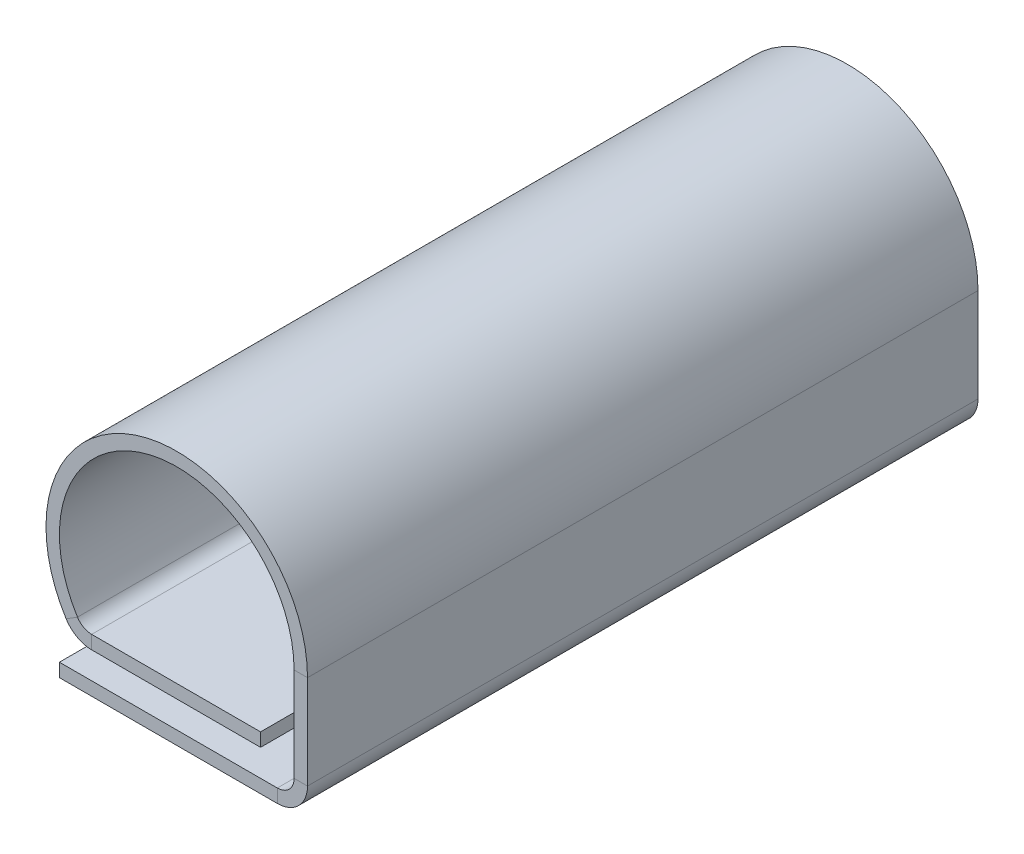
ISO-10303-21;
HEADER;
FILE_DESCRIPTION(('STEP AP214'),'2;1');
FILE_NAME('part.step','',(''),(''),'','','');
FILE_SCHEMA(('AUTOMOTIVE_DESIGN { 1 0 10303 214 1 1 1 1 }'));
ENDSEC;
DATA;
#1=APPLICATION_CONTEXT('core data for automotive mechanical design processes');
#2=APPLICATION_PROTOCOL_DEFINITION('international standard','automotive_design',2000,#1);
#3=PRODUCT_CONTEXT('',#1,'mechanical');
#4=PRODUCT('Part','Part','',(#3));
#5=PRODUCT_RELATED_PRODUCT_CATEGORY('part','',(#4));
#6=PRODUCT_DEFINITION_FORMATION('','',#4);
#7=PRODUCT_DEFINITION_CONTEXT('part definition',#1,'design');
#8=PRODUCT_DEFINITION('design','',#6,#7);
#9=PRODUCT_DEFINITION_SHAPE('','',#8);
#10=(LENGTH_UNIT() NAMED_UNIT(*) SI_UNIT(.MILLI.,.METRE.));
#11=(NAMED_UNIT(*) PLANE_ANGLE_UNIT() SI_UNIT($,.RADIAN.));
#12=(NAMED_UNIT(*) SI_UNIT($,.STERADIAN.) SOLID_ANGLE_UNIT());
#13=UNCERTAINTY_MEASURE_WITH_UNIT(LENGTH_MEASURE(1.E-05),#10,'distance_accuracy_value','');
#14=(GEOMETRIC_REPRESENTATION_CONTEXT(3) GLOBAL_UNCERTAINTY_ASSIGNED_CONTEXT((#13)) GLOBAL_UNIT_ASSIGNED_CONTEXT((#10,
#11,#12)) REPRESENTATION_CONTEXT('',''));
#15=CARTESIAN_POINT('',(0.,0.,0.));
#16=DIRECTION('',(0.,0.,1.));
#17=DIRECTION('',(1.,0.,0.));
#18=AXIS2_PLACEMENT_3D('',#15,#16,#17);
#19=CARTESIAN_POINT('',(1.95,1.65,10.));
#20=DIRECTION('',(0.,0.,1.));
#21=DIRECTION('',(1.,0.,0.));
#22=AXIS2_PLACEMENT_3D('',#19,#20,#21);
#23=PLANE('',#22);
#24=DIRECTION('',(-1.,0.,0.));
#25=VECTOR('',#24,1.);
#26=CARTESIAN_POINT('',(1.95,1.65,10.));
#27=LINE('',#26,#25);
#28=CARTESIAN_POINT('',(1.95,1.65,10.));
#29=VERTEX_POINT('',#28);
#30=CARTESIAN_POINT('',(1.75,1.65,10.));
#31=VERTEX_POINT('',#30);
#32=EDGE_CURVE('E11',#29,#31,#27,.T.);
#33=ORIENTED_EDGE('',*,*,#32,.F.);
#34=CARTESIAN_POINT('',(0.,1.65,10.));
#35=DIRECTION('',(0.,0.,1.));
#36=DIRECTION('',(1.,0.,0.));
#37=AXIS2_PLACEMENT_3D('',#34,#35,#36);
#38=CIRCLE('',#37,1.95);
#39=CARTESIAN_POINT('',(-1.64951508025844,0.61,10.));
#40=VERTEX_POINT('',#39);
#41=EDGE_CURVE('E145',#29,#40,#38,.T.);
#42=ORIENTED_EDGE('',*,*,#41,.T.);
#43=DIRECTION('',(0.845905169363302,0.533333333333333,0.));
#44=VECTOR('',#43,1.);
#45=CARTESIAN_POINT('',(-1.64951508025844,0.61,10.));
#46=LINE('',#45,#44);
#47=CARTESIAN_POINT('',(-1.48033404638578,0.716666666666667,10.));
#48=VERTEX_POINT('',#47);
#49=EDGE_CURVE('E250',#40,#48,#46,.T.);
#50=ORIENTED_EDGE('',*,*,#49,.T.);
#51=CARTESIAN_POINT('',(0.,1.65,10.));
#52=DIRECTION('',(0.,0.,1.));
#53=DIRECTION('',(1.,0.,0.));
#54=AXIS2_PLACEMENT_3D('',#51,#52,#53);
#55=CIRCLE('',#54,1.75);
#56=EDGE_CURVE('E148',#31,#48,#55,.T.);
#57=ORIENTED_EDGE('',*,*,#56,.F.);
#58=EDGE_LOOP('',(#33,#42,#50,#57));
#59=FACE_BOUND('',#58,.T.);
#60=ADVANCED_FACE('F34',(#59),#23,.T.);
#61=CARTESIAN_POINT('',(1.75,1.65,0.));
#62=DIRECTION('',(0.,0.,-1.));
#63=DIRECTION('',(-1.,0.,0.));
#64=AXIS2_PLACEMENT_3D('',#61,#62,#63);
#65=PLANE('',#64);
#66=DIRECTION('',(1.,0.,0.));
#67=VECTOR('',#66,1.);
#68=CARTESIAN_POINT('',(1.75,1.65,0.));
#69=LINE('',#68,#67);
#70=CARTESIAN_POINT('',(1.75,1.65,0.));
#71=VERTEX_POINT('',#70);
#72=CARTESIAN_POINT('',(1.95,1.65,0.));
#73=VERTEX_POINT('',#72);
#74=EDGE_CURVE('E42',#71,#73,#69,.T.);
#75=ORIENTED_EDGE('',*,*,#74,.F.);
#76=CARTESIAN_POINT('',(0.,1.65,0.));
#77=DIRECTION('',(0.,0.,1.));
#78=DIRECTION('',(1.,0.,0.));
#79=AXIS2_PLACEMENT_3D('',#76,#77,#78);
#80=CIRCLE('',#79,1.75);
#81=CARTESIAN_POINT('',(-1.48033404638578,0.716666666666667,0.));
#82=VERTEX_POINT('',#81);
#83=EDGE_CURVE('E193',#71,#82,#80,.T.);
#84=ORIENTED_EDGE('',*,*,#83,.T.);
#85=DIRECTION('',(-0.845905169363302,-0.533333333333333,0.));
#86=VECTOR('',#85,1.);
#87=CARTESIAN_POINT('',(-1.48033404638578,0.716666666666667,0.));
#88=LINE('',#87,#86);
#89=CARTESIAN_POINT('',(-1.64951508025844,0.61,0.));
#90=VERTEX_POINT('',#89);
#91=EDGE_CURVE('E97',#82,#90,#88,.T.);
#92=ORIENTED_EDGE('',*,*,#91,.T.);
#93=CARTESIAN_POINT('',(0.,1.65,0.));
#94=DIRECTION('',(0.,0.,1.));
#95=DIRECTION('',(1.,0.,0.));
#96=AXIS2_PLACEMENT_3D('',#93,#94,#95);
#97=CIRCLE('',#96,1.95);
#98=EDGE_CURVE('E214',#73,#90,#97,.T.);
#99=ORIENTED_EDGE('',*,*,#98,.F.);
#100=EDGE_LOOP('',(#75,#84,#92,#99));
#101=FACE_BOUND('',#100,.T.);
#102=ADVANCED_FACE('F262',(#101),#65,.T.);
#103=CARTESIAN_POINT('',(1.75,0.25,10.));
#104=DIRECTION('',(0.,0.,1.));
#105=DIRECTION('',(1.,0.,0.));
#106=AXIS2_PLACEMENT_3D('',#103,#104,#105);
#107=PLANE('',#106);
#108=DIRECTION('',(1.,0.,0.));
#109=VECTOR('',#108,1.);
#110=CARTESIAN_POINT('',(1.75,0.25,10.));
#111=LINE('',#110,#109);
#112=CARTESIAN_POINT('',(1.75,0.25,10.));
#113=VERTEX_POINT('',#112);
#114=CARTESIAN_POINT('',(1.95,0.25,10.));
#115=VERTEX_POINT('',#114);
#116=EDGE_CURVE('E157',#113,#115,#111,.T.);
#117=ORIENTED_EDGE('',*,*,#116,.F.);
#118=CARTESIAN_POINT('',(1.5,0.25,10.));
#119=DIRECTION('',(0.,0.,-1.));
#120=DIRECTION('',(-1.,0.,0.));
#121=AXIS2_PLACEMENT_3D('',#118,#119,#120);
#122=CIRCLE('',#121,0.25);
#123=CARTESIAN_POINT('',(1.5,0.,10.));
#124=VERTEX_POINT('',#123);
#125=EDGE_CURVE('E302',#124,#113,#122,.F.);
#126=ORIENTED_EDGE('',*,*,#125,.F.);
#127=DIRECTION('',(0.,1.,0.));
#128=VECTOR('',#127,1.);
#129=CARTESIAN_POINT('',(1.5,-0.2,10.));
#130=LINE('',#129,#128);
#131=CARTESIAN_POINT('',(1.5,-0.2,10.));
#132=VERTEX_POINT('',#131);
#133=EDGE_CURVE('E257',#132,#124,#130,.T.);
#134=ORIENTED_EDGE('',*,*,#133,.F.);
#135=CARTESIAN_POINT('',(1.5,0.25,10.));
#136=DIRECTION('',(0.,0.,1.));
#137=DIRECTION('',(1.,0.,0.));
#138=AXIS2_PLACEMENT_3D('',#135,#136,#137);
#139=CIRCLE('',#138,0.45);
#140=EDGE_CURVE('E161',#132,#115,#139,.T.);
#141=ORIENTED_EDGE('',*,*,#140,.T.);
#142=EDGE_LOOP('',(#117,#126,#134,#141));
#143=FACE_BOUND('',#142,.T.);
#144=ADVANCED_FACE('F316',(#143),#107,.T.);
#145=CARTESIAN_POINT('',(1.5,-0.2,10.));
#146=DIRECTION('',(0.,0.,1.));
#147=DIRECTION('',(1.,0.,0.));
#148=AXIS2_PLACEMENT_3D('',#145,#146,#147);
#149=PLANE('',#148);
#150=DIRECTION('',(0.,1.,0.));
#151=VECTOR('',#150,1.);
#152=CARTESIAN_POINT('',(1.75,0.,10.));
#153=LINE('',#152,#151);
#154=EDGE_CURVE('E267',#113,#31,#153,.T.);
#155=ORIENTED_EDGE('',*,*,#154,.F.);
#156=ORIENTED_EDGE('',*,*,#116,.T.);
#157=DIRECTION('',(0.,1.,0.));
#158=VECTOR('',#157,1.);
#159=CARTESIAN_POINT('',(1.95,0.,10.));
#160=LINE('',#159,#158);
#161=EDGE_CURVE('E154',#115,#29,#160,.T.);
#162=ORIENTED_EDGE('',*,*,#161,.T.);
#163=ORIENTED_EDGE('',*,*,#32,.T.);
#164=EDGE_LOOP('',(#155,#156,#162,#163));
#165=FACE_BOUND('',#164,.T.);
#166=ADVANCED_FACE('F156',(#165),#149,.T.);
#167=CARTESIAN_POINT('',(1.5,0.,0.));
#168=DIRECTION('',(0.,0.,-1.));
#169=DIRECTION('',(-1.,0.,0.));
#170=AXIS2_PLACEMENT_3D('',#167,#168,#169);
#171=PLANE('',#170);
#172=DIRECTION('',(0.,-1.,0.));
#173=VECTOR('',#172,1.);
#174=CARTESIAN_POINT('',(1.5,0.,0.));
#175=LINE('',#174,#173);
#176=CARTESIAN_POINT('',(1.5,0.,0.));
#177=VERTEX_POINT('',#176);
#178=CARTESIAN_POINT('',(1.5,-0.2,0.));
#179=VERTEX_POINT('',#178);
#180=EDGE_CURVE('E255',#177,#179,#175,.T.);
#181=ORIENTED_EDGE('',*,*,#180,.F.);
#182=CARTESIAN_POINT('',(1.5,0.25,0.));
#183=DIRECTION('',(0.,0.,-1.));
#184=DIRECTION('',(-1.,0.,0.));
#185=AXIS2_PLACEMENT_3D('',#182,#183,#184);
#186=CIRCLE('',#185,0.25);
#187=CARTESIAN_POINT('',(1.75,0.25,0.));
#188=VERTEX_POINT('',#187);
#189=EDGE_CURVE('E198',#177,#188,#186,.F.);
#190=ORIENTED_EDGE('',*,*,#189,.T.);
#191=DIRECTION('',(-1.,0.,0.));
#192=VECTOR('',#191,1.);
#193=CARTESIAN_POINT('',(1.95,0.25,0.));
#194=LINE('',#193,#192);
#195=CARTESIAN_POINT('',(1.95,0.25,0.));
#196=VERTEX_POINT('',#195);
#197=EDGE_CURVE('E253',#196,#188,#194,.T.);
#198=ORIENTED_EDGE('',*,*,#197,.F.);
#199=CARTESIAN_POINT('',(1.5,0.25,0.));
#200=DIRECTION('',(0.,0.,1.));
#201=DIRECTION('',(1.,0.,0.));
#202=AXIS2_PLACEMENT_3D('',#199,#200,#201);
#203=CIRCLE('',#202,0.45);
#204=EDGE_CURVE('E210',#179,#196,#203,.T.);
#205=ORIENTED_EDGE('',*,*,#204,.F.);
#206=EDGE_LOOP('',(#181,#190,#198,#205));
#207=FACE_BOUND('',#206,.T.);
#208=ADVANCED_FACE('F323',(#207),#171,.T.);
#209=CARTESIAN_POINT('',(1.95,0.25,0.));
#210=DIRECTION('',(0.,0.,-1.));
#211=DIRECTION('',(-1.,0.,0.));
#212=AXIS2_PLACEMENT_3D('',#209,#210,#211);
#213=PLANE('',#212);
#214=DIRECTION('',(1.,0.,0.));
#215=VECTOR('',#214,1.);
#216=CARTESIAN_POINT('',(-1.75,0.,0.));
#217=LINE('',#216,#215);
#218=CARTESIAN_POINT('',(-1.75,0.,0.));
#219=VERTEX_POINT('',#218);
#220=EDGE_CURVE('E201',#219,#177,#217,.T.);
#221=ORIENTED_EDGE('',*,*,#220,.T.);
#222=ORIENTED_EDGE('',*,*,#180,.T.);
#223=DIRECTION('',(1.,0.,0.));
#224=VECTOR('',#223,1.);
#225=CARTESIAN_POINT('',(-1.75,-0.2,0.));
#226=LINE('',#225,#224);
#227=CARTESIAN_POINT('',(-1.75,-0.2,0.));
#228=VERTEX_POINT('',#227);
#229=EDGE_CURVE('E207',#228,#179,#226,.T.);
#230=ORIENTED_EDGE('',*,*,#229,.F.);
#231=DIRECTION('',(0.,1.,0.));
#232=VECTOR('',#231,1.);
#233=CARTESIAN_POINT('',(-1.75,-0.2,0.));
#234=LINE('',#233,#232);
#235=EDGE_CURVE('E204',#228,#219,#234,.T.);
#236=ORIENTED_EDGE('',*,*,#235,.T.);
#237=EDGE_LOOP('',(#221,#222,#230,#236));
#238=FACE_BOUND('',#237,.T.);
#239=ADVANCED_FACE('F343',(#238),#213,.T.);
#240=CARTESIAN_POINT('',(-1.26885775404495,0.6,10.));
#241=DIRECTION('',(0.,0.,1.));
#242=DIRECTION('',(1.,0.,0.));
#243=AXIS2_PLACEMENT_3D('',#240,#241,#242);
#244=PLANE('',#243);
#245=DIRECTION('',(0.,-1.,0.));
#246=VECTOR('',#245,1.);
#247=CARTESIAN_POINT('',(-1.26885775404495,0.6,10.));
#248=LINE('',#247,#246);
#249=CARTESIAN_POINT('',(-1.26885775404495,0.6,10.));
#250=VERTEX_POINT('',#249);
#251=CARTESIAN_POINT('',(-1.26885775404495,0.4,10.));
#252=VERTEX_POINT('',#251);
#253=EDGE_CURVE('E50',#250,#252,#248,.T.);
#254=ORIENTED_EDGE('',*,*,#253,.F.);
#255=CARTESIAN_POINT('',(-1.26885775404495,0.85,10.));
#256=DIRECTION('',(0.,0.,1.));
#257=DIRECTION('',(1.,0.,0.));
#258=AXIS2_PLACEMENT_3D('',#255,#256,#257);
#259=CIRCLE('',#258,0.25);
#260=EDGE_CURVE('E295',#48,#250,#259,.T.);
#261=ORIENTED_EDGE('',*,*,#260,.F.);
#262=ORIENTED_EDGE('',*,*,#49,.F.);
#263=CARTESIAN_POINT('',(-1.26885775404495,0.85,10.));
#264=DIRECTION('',(0.,0.,1.));
#265=DIRECTION('',(1.,0.,0.));
#266=AXIS2_PLACEMENT_3D('',#263,#264,#265);
#267=CIRCLE('',#266,0.45);
#268=EDGE_CURVE('E176',#40,#252,#267,.T.);
#269=ORIENTED_EDGE('',*,*,#268,.T.);
#270=EDGE_LOOP('',(#254,#261,#262,#269));
#271=FACE_BOUND('',#270,.T.);
#272=ADVANCED_FACE('F345',(#271),#244,.T.);
#273=CARTESIAN_POINT('',(-1.64951508025844,0.61,10.));
#274=DIRECTION('',(0.,0.,1.));
#275=DIRECTION('',(1.,0.,0.));
#276=AXIS2_PLACEMENT_3D('',#273,#274,#275);
#277=PLANE('',#276);
#278=DIRECTION('',(1.,0.,0.));
#279=VECTOR('',#278,1.);
#280=CARTESIAN_POINT('',(-1.4,0.6,10.));
#281=LINE('',#280,#279);
#282=CARTESIAN_POINT('',(1.25,0.6,10.));
#283=VERTEX_POINT('',#282);
#284=EDGE_CURVE('E293',#250,#283,#281,.T.);
#285=ORIENTED_EDGE('',*,*,#284,.F.);
#286=ORIENTED_EDGE('',*,*,#253,.T.);
#287=DIRECTION('',(1.,0.,0.));
#288=VECTOR('',#287,1.);
#289=CARTESIAN_POINT('',(-1.4,0.4,10.));
#290=LINE('',#289,#288);
#291=CARTESIAN_POINT('',(1.25,0.4,10.));
#292=VERTEX_POINT('',#291);
#293=EDGE_CURVE('E110',#252,#292,#290,.T.);
#294=ORIENTED_EDGE('',*,*,#293,.T.);
#295=DIRECTION('',(0.,-1.,0.));
#296=VECTOR('',#295,1.);
#297=CARTESIAN_POINT('',(1.25,0.6,10.));
#298=LINE('',#297,#296);
#299=EDGE_CURVE('E291',#283,#292,#298,.T.);
#300=ORIENTED_EDGE('',*,*,#299,.F.);
#301=EDGE_LOOP('',(#285,#286,#294,#300));
#302=FACE_BOUND('',#301,.T.);
#303=ADVANCED_FACE('F351',(#302),#277,.T.);
#304=CARTESIAN_POINT('',(-1.48033404638578,0.716666666666667,0.));
#305=DIRECTION('',(0.,0.,-1.));
#306=DIRECTION('',(-1.,0.,0.));
#307=AXIS2_PLACEMENT_3D('',#304,#305,#306);
#308=PLANE('',#307);
#309=ORIENTED_EDGE('',*,*,#91,.F.);
#310=CARTESIAN_POINT('',(-1.26885775404495,0.85,0.));
#311=DIRECTION('',(0.,0.,1.));
#312=DIRECTION('',(1.,0.,0.));
#313=AXIS2_PLACEMENT_3D('',#310,#311,#312);
#314=CIRCLE('',#313,0.25);
#315=CARTESIAN_POINT('',(-1.26885775404495,0.6,0.));
#316=VERTEX_POINT('',#315);
#317=EDGE_CURVE('E191',#82,#316,#314,.T.);
#318=ORIENTED_EDGE('',*,*,#317,.T.);
#319=DIRECTION('',(0.,1.,0.));
#320=VECTOR('',#319,1.);
#321=CARTESIAN_POINT('',(-1.26885775404495,0.4,0.));
#322=LINE('',#321,#320);
#323=CARTESIAN_POINT('',(-1.26885775404495,0.4,0.));
#324=VERTEX_POINT('',#323);
#325=EDGE_CURVE('E104',#324,#316,#322,.T.);
#326=ORIENTED_EDGE('',*,*,#325,.F.);
#327=CARTESIAN_POINT('',(-1.26885775404495,0.85,0.));
#328=DIRECTION('',(0.,0.,1.));
#329=DIRECTION('',(1.,0.,0.));
#330=AXIS2_PLACEMENT_3D('',#327,#328,#329);
#331=CIRCLE('',#330,0.45);
#332=EDGE_CURVE('E216',#90,#324,#331,.T.);
#333=ORIENTED_EDGE('',*,*,#332,.F.);
#334=EDGE_LOOP('',(#309,#318,#326,#333));
#335=FACE_BOUND('',#334,.T.);
#336=ADVANCED_FACE('F278',(#335),#308,.T.);
#337=CARTESIAN_POINT('',(-1.26885775404495,0.4,0.));
#338=DIRECTION('',(0.,0.,-1.));
#339=DIRECTION('',(-1.,0.,0.));
#340=AXIS2_PLACEMENT_3D('',#337,#338,#339);
#341=PLANE('',#340);
#342=DIRECTION('',(0.,1.,0.));
#343=VECTOR('',#342,1.);
#344=CARTESIAN_POINT('',(1.75,0.,0.));
#345=LINE('',#344,#343);
#346=EDGE_CURVE('E195',#188,#71,#345,.T.);
#347=ORIENTED_EDGE('',*,*,#346,.T.);
#348=ORIENTED_EDGE('',*,*,#74,.T.);
#349=DIRECTION('',(0.,1.,0.));
#350=VECTOR('',#349,1.);
#351=CARTESIAN_POINT('',(1.95,0.,0.));
#352=LINE('',#351,#350);
#353=EDGE_CURVE('E168',#196,#73,#352,.T.);
#354=ORIENTED_EDGE('',*,*,#353,.F.);
#355=ORIENTED_EDGE('',*,*,#197,.T.);
#356=EDGE_LOOP('',(#347,#348,#354,#355));
#357=FACE_BOUND('',#356,.T.);
#358=ADVANCED_FACE('F260',(#357),#341,.T.);
#359=CARTESIAN_POINT('',(-1.4,0.4,10.));
#360=DIRECTION('',(0.,1.,0.));
#361=DIRECTION('',(-1.,0.,0.));
#362=AXIS2_PLACEMENT_3D('',#359,#360,#361);
#363=PLANE('',#362);
#364=DIRECTION('',(1.,0.,0.));
#365=VECTOR('',#364,1.);
#366=CARTESIAN_POINT('',(-1.4,0.4,0.));
#367=LINE('',#366,#365);
#368=CARTESIAN_POINT('',(1.25,0.4,0.));
#369=VERTEX_POINT('',#368);
#370=EDGE_CURVE('E182',#324,#369,#367,.T.);
#371=ORIENTED_EDGE('',*,*,#370,.T.);
#372=DIRECTION('',(0.,0.,-1.));
#373=VECTOR('',#372,1.);
#374=CARTESIAN_POINT('',(1.25,0.4,10.));
#375=LINE('',#374,#373);
#376=EDGE_CURVE('E246',#292,#369,#375,.T.);
#377=ORIENTED_EDGE('',*,*,#376,.F.);
#378=ORIENTED_EDGE('',*,*,#293,.F.);
#379=DIRECTION('',(0.,0.,-1.));
#380=VECTOR('',#379,1.);
#381=CARTESIAN_POINT('',(-1.26885775404495,0.4,10.));
#382=LINE('',#381,#380);
#383=EDGE_CURVE('E178',#252,#324,#382,.T.);
#384=ORIENTED_EDGE('',*,*,#383,.T.);
#385=EDGE_LOOP('',(#371,#377,#378,#384));
#386=FACE_BOUND('',#385,.T.);
#387=ADVANCED_FACE('F284',(#386),#363,.F.);
#388=CARTESIAN_POINT('',(1.25,0.6,10.));
#389=DIRECTION('',(1.,0.,0.));
#390=DIRECTION('',(0.,0.,-1.));
#391=AXIS2_PLACEMENT_3D('',#388,#389,#390);
#392=PLANE('',#391);
#393=DIRECTION('',(0.,-1.,0.));
#394=VECTOR('',#393,1.);
#395=CARTESIAN_POINT('',(1.25,0.6,0.));
#396=LINE('',#395,#394);
#397=CARTESIAN_POINT('',(1.25,0.6,0.));
#398=VERTEX_POINT('',#397);
#399=EDGE_CURVE('E185',#398,#369,#396,.T.);
#400=ORIENTED_EDGE('',*,*,#399,.F.);
#401=DIRECTION('',(0.,0.,-1.));
#402=VECTOR('',#401,1.);
#403=CARTESIAN_POINT('',(1.25,0.6,10.));
#404=LINE('',#403,#402);
#405=EDGE_CURVE('E244',#283,#398,#404,.T.);
#406=ORIENTED_EDGE('',*,*,#405,.F.);
#407=ORIENTED_EDGE('',*,*,#299,.T.);
#408=ORIENTED_EDGE('',*,*,#376,.T.);
#409=EDGE_LOOP('',(#400,#406,#407,#408));
#410=FACE_BOUND('',#409,.T.);
#411=ADVANCED_FACE('F289',(#410),#392,.T.);
#412=CARTESIAN_POINT('',(-1.4,0.6,10.));
#413=DIRECTION('',(0.,1.,0.));
#414=DIRECTION('',(-1.,0.,0.));
#415=AXIS2_PLACEMENT_3D('',#412,#413,#414);
#416=PLANE('',#415);
#417=DIRECTION('',(1.,0.,0.));
#418=VECTOR('',#417,1.);
#419=CARTESIAN_POINT('',(-1.4,0.6,0.));
#420=LINE('',#419,#418);
#421=EDGE_CURVE('E188',#316,#398,#420,.T.);
#422=ORIENTED_EDGE('',*,*,#421,.F.);
#423=DIRECTION('',(0.,0.,-1.));
#424=VECTOR('',#423,1.);
#425=CARTESIAN_POINT('',(-1.26885775404495,0.6,10.));
#426=LINE('',#425,#424);
#427=EDGE_CURVE('E241',#250,#316,#426,.T.);
#428=ORIENTED_EDGE('',*,*,#427,.F.);
#429=ORIENTED_EDGE('',*,*,#284,.T.);
#430=ORIENTED_EDGE('',*,*,#405,.T.);
#431=EDGE_LOOP('',(#422,#428,#429,#430));
#432=FACE_BOUND('',#431,.T.);
#433=ADVANCED_FACE('F431',(#432),#416,.T.);
#434=CARTESIAN_POINT('',(-1.26885775404495,0.85,10.));
#435=DIRECTION('',(0.,0.,-1.));
#436=DIRECTION('',(-1.,0.,0.));
#437=AXIS2_PLACEMENT_3D('',#434,#435,#436);
#438=CYLINDRICAL_SURFACE('',#437,0.25);
#439=ORIENTED_EDGE('',*,*,#317,.F.);
#440=DIRECTION('',(0.,0.,-1.));
#441=VECTOR('',#440,1.);
#442=CARTESIAN_POINT('',(-1.48033404638578,0.716666666666667,10.));
#443=LINE('',#442,#441);
#444=EDGE_CURVE('E238',#48,#82,#443,.T.);
#445=ORIENTED_EDGE('',*,*,#444,.F.);
#446=ORIENTED_EDGE('',*,*,#260,.T.);
#447=ORIENTED_EDGE('',*,*,#427,.T.);
#448=EDGE_LOOP('',(#439,#445,#446,#447));
#449=FACE_BOUND('',#448,.T.);
#450=ADVANCED_FACE('F275',(#449),#438,.F.);
#451=CARTESIAN_POINT('',(0.,1.65,10.));
#452=DIRECTION('',(0.,0.,-1.));
#453=DIRECTION('',(-1.,0.,0.));
#454=AXIS2_PLACEMENT_3D('',#451,#452,#453);
#455=CYLINDRICAL_SURFACE('',#454,1.75);
#456=ORIENTED_EDGE('',*,*,#83,.F.);
#457=DIRECTION('',(0.,0.,-1.));
#458=VECTOR('',#457,1.);
#459=CARTESIAN_POINT('',(1.75,1.65,10.));
#460=LINE('',#459,#458);
#461=EDGE_CURVE('E235',#31,#71,#460,.T.);
#462=ORIENTED_EDGE('',*,*,#461,.F.);
#463=ORIENTED_EDGE('',*,*,#56,.T.);
#464=ORIENTED_EDGE('',*,*,#444,.T.);
#465=EDGE_LOOP('',(#456,#462,#463,#464));
#466=FACE_BOUND('',#465,.T.);
#467=ADVANCED_FACE('F269',(#466),#455,.F.);
#468=CARTESIAN_POINT('',(1.75,0.,10.));
#469=DIRECTION('',(-1.,0.,0.));
#470=DIRECTION('',(0.,-1.,0.));
#471=AXIS2_PLACEMENT_3D('',#468,#469,#470);
#472=PLANE('',#471);
#473=ORIENTED_EDGE('',*,*,#346,.F.);
#474=DIRECTION('',(0.,0.,-1.));
#475=VECTOR('',#474,1.);
#476=CARTESIAN_POINT('',(1.75,0.25,10.));
#477=LINE('',#476,#475);
#478=EDGE_CURVE('E232',#113,#188,#477,.T.);
#479=ORIENTED_EDGE('',*,*,#478,.F.);
#480=ORIENTED_EDGE('',*,*,#154,.T.);
#481=ORIENTED_EDGE('',*,*,#461,.T.);
#482=EDGE_LOOP('',(#473,#479,#480,#481));
#483=FACE_BOUND('',#482,.T.);
#484=ADVANCED_FACE('F265',(#483),#472,.T.);
#485=CARTESIAN_POINT('',(1.5,0.25,10.));
#486=DIRECTION('',(0.,0.,-1.));
#487=DIRECTION('',(-1.,0.,0.));
#488=AXIS2_PLACEMENT_3D('',#485,#486,#487);
#489=CYLINDRICAL_SURFACE('',#488,0.25);
#490=ORIENTED_EDGE('',*,*,#189,.F.);
#491=DIRECTION('',(0.,0.,-1.));
#492=VECTOR('',#491,1.);
#493=CARTESIAN_POINT('',(1.5,0.,10.));
#494=LINE('',#493,#492);
#495=EDGE_CURVE('E229',#124,#177,#494,.T.);
#496=ORIENTED_EDGE('',*,*,#495,.F.);
#497=ORIENTED_EDGE('',*,*,#125,.T.);
#498=ORIENTED_EDGE('',*,*,#478,.T.);
#499=EDGE_LOOP('',(#490,#496,#497,#498));
#500=FACE_BOUND('',#499,.T.);
#501=ADVANCED_FACE('F326',(#500),#489,.F.);
#502=CARTESIAN_POINT('',(-1.75,0.,10.));
#503=DIRECTION('',(0.,1.,0.));
#504=DIRECTION('',(0.,0.,1.));
#505=AXIS2_PLACEMENT_3D('',#502,#503,#504);
#506=PLANE('',#505);
#507=ORIENTED_EDGE('',*,*,#220,.F.);
#508=DIRECTION('',(0.,0.,-1.));
#509=VECTOR('',#508,1.);
#510=CARTESIAN_POINT('',(-1.75,0.,10.));
#511=LINE('',#510,#509);
#512=CARTESIAN_POINT('',(-1.75,0.,10.));
#513=VERTEX_POINT('',#512);
#514=EDGE_CURVE('E227',#513,#219,#511,.T.);
#515=ORIENTED_EDGE('',*,*,#514,.F.);
#516=DIRECTION('',(1.,0.,0.));
#517=VECTOR('',#516,1.);
#518=CARTESIAN_POINT('',(-1.75,0.,10.));
#519=LINE('',#518,#517);
#520=EDGE_CURVE('E305',#513,#124,#519,.T.);
#521=ORIENTED_EDGE('',*,*,#520,.T.);
#522=ORIENTED_EDGE('',*,*,#495,.T.);
#523=EDGE_LOOP('',(#507,#515,#521,#522));
#524=FACE_BOUND('',#523,.T.);
#525=ADVANCED_FACE('F331',(#524),#506,.T.);
#526=CARTESIAN_POINT('',(-1.75,-0.2,10.));
#527=DIRECTION('',(-1.,0.,0.));
#528=DIRECTION('',(0.,0.,1.));
#529=AXIS2_PLACEMENT_3D('',#526,#527,#528);
#530=PLANE('',#529);
#531=ORIENTED_EDGE('',*,*,#235,.F.);
#532=DIRECTION('',(0.,0.,-1.));
#533=VECTOR('',#532,1.);
#534=CARTESIAN_POINT('',(-1.75,-0.2,10.));
#535=LINE('',#534,#533);
#536=CARTESIAN_POINT('',(-1.75,-0.2,10.));
#537=VERTEX_POINT('',#536);
#538=EDGE_CURVE('E225',#537,#228,#535,.T.);
#539=ORIENTED_EDGE('',*,*,#538,.F.);
#540=DIRECTION('',(0.,1.,0.));
#541=VECTOR('',#540,1.);
#542=CARTESIAN_POINT('',(-1.75,-0.2,10.));
#543=LINE('',#542,#541);
#544=EDGE_CURVE('E308',#537,#513,#543,.T.);
#545=ORIENTED_EDGE('',*,*,#544,.T.);
#546=ORIENTED_EDGE('',*,*,#514,.T.);
#547=EDGE_LOOP('',(#531,#539,#545,#546));
#548=FACE_BOUND('',#547,.T.);
#549=ADVANCED_FACE('F337',(#548),#530,.T.);
#550=CARTESIAN_POINT('',(-1.75,-0.2,10.));
#551=DIRECTION('',(0.,1.,0.));
#552=DIRECTION('',(0.,0.,1.));
#553=AXIS2_PLACEMENT_3D('',#550,#551,#552);
#554=PLANE('',#553);
#555=ORIENTED_EDGE('',*,*,#229,.T.);
#556=DIRECTION('',(0.,0.,-1.));
#557=VECTOR('',#556,1.);
#558=CARTESIAN_POINT('',(1.5,-0.2,10.));
#559=LINE('',#558,#557);
#560=EDGE_CURVE('E222',#132,#179,#559,.T.);
#561=ORIENTED_EDGE('',*,*,#560,.F.);
#562=DIRECTION('',(1.,0.,0.));
#563=VECTOR('',#562,1.);
#564=CARTESIAN_POINT('',(-1.75,-0.2,10.));
#565=LINE('',#564,#563);
#566=EDGE_CURVE('E311',#537,#132,#565,.T.);
#567=ORIENTED_EDGE('',*,*,#566,.F.);
#568=ORIENTED_EDGE('',*,*,#538,.T.);
#569=EDGE_LOOP('',(#555,#561,#567,#568));
#570=FACE_BOUND('',#569,.T.);
#571=ADVANCED_FACE('F341',(#570),#554,.F.);
#572=CARTESIAN_POINT('',(1.5,0.25,10.));
#573=DIRECTION('',(0.,0.,-1.));
#574=DIRECTION('',(-1.,0.,0.));
#575=AXIS2_PLACEMENT_3D('',#572,#573,#574);
#576=CYLINDRICAL_SURFACE('',#575,0.45);
#577=ORIENTED_EDGE('',*,*,#204,.T.);
#578=DIRECTION('',(0.,0.,-1.));
#579=VECTOR('',#578,1.);
#580=CARTESIAN_POINT('',(1.95,0.25,10.));
#581=LINE('',#580,#579);
#582=EDGE_CURVE('E170',#115,#196,#581,.T.);
#583=ORIENTED_EDGE('',*,*,#582,.F.);
#584=ORIENTED_EDGE('',*,*,#140,.F.);
#585=ORIENTED_EDGE('',*,*,#560,.T.);
#586=EDGE_LOOP('',(#577,#583,#584,#585));
#587=FACE_BOUND('',#586,.T.);
#588=ADVANCED_FACE('F319',(#587),#576,.T.);
#589=CARTESIAN_POINT('',(1.95,0.,10.));
#590=DIRECTION('',(-1.,0.,0.));
#591=DIRECTION('',(0.,-1.,0.));
#592=AXIS2_PLACEMENT_3D('',#589,#590,#591);
#593=PLANE('',#592);
#594=ORIENTED_EDGE('',*,*,#353,.T.);
#595=DIRECTION('',(0.,0.,-1.));
#596=VECTOR('',#595,1.);
#597=CARTESIAN_POINT('',(1.95,1.65,10.));
#598=LINE('',#597,#596);
#599=EDGE_CURVE('E165',#29,#73,#598,.T.);
#600=ORIENTED_EDGE('',*,*,#599,.F.);
#601=ORIENTED_EDGE('',*,*,#161,.F.);
#602=ORIENTED_EDGE('',*,*,#582,.T.);
#603=EDGE_LOOP('',(#594,#600,#601,#602));
#604=FACE_BOUND('',#603,.T.);
#605=ADVANCED_FACE('F166',(#604),#593,.F.);
#606=CARTESIAN_POINT('',(0.,1.65,10.));
#607=DIRECTION('',(0.,0.,-1.));
#608=DIRECTION('',(-1.,0.,0.));
#609=AXIS2_PLACEMENT_3D('',#606,#607,#608);
#610=CYLINDRICAL_SURFACE('',#609,1.95);
#611=ORIENTED_EDGE('',*,*,#98,.T.);
#612=DIRECTION('',(0.,0.,-1.));
#613=VECTOR('',#612,1.);
#614=CARTESIAN_POINT('',(-1.64951508025844,0.61,10.));
#615=LINE('',#614,#613);
#616=EDGE_CURVE('E171',#40,#90,#615,.T.);
#617=ORIENTED_EDGE('',*,*,#616,.F.);
#618=ORIENTED_EDGE('',*,*,#41,.F.);
#619=ORIENTED_EDGE('',*,*,#599,.T.);
#620=EDGE_LOOP('',(#611,#617,#618,#619));
#621=FACE_BOUND('',#620,.T.);
#622=ADVANCED_FACE('F173',(#621),#610,.T.);
#623=CARTESIAN_POINT('',(-1.26885775404495,0.85,10.));
#624=DIRECTION('',(0.,0.,-1.));
#625=DIRECTION('',(-1.,0.,0.));
#626=AXIS2_PLACEMENT_3D('',#623,#624,#625);
#627=CYLINDRICAL_SURFACE('',#626,0.45);
#628=ORIENTED_EDGE('',*,*,#332,.T.);
#629=ORIENTED_EDGE('',*,*,#383,.F.);
#630=ORIENTED_EDGE('',*,*,#268,.F.);
#631=ORIENTED_EDGE('',*,*,#616,.T.);
#632=EDGE_LOOP('',(#628,#629,#630,#631));
#633=FACE_BOUND('',#632,.T.);
#634=ADVANCED_FACE('F281',(#633),#627,.T.);
#635=CARTESIAN_POINT('',(-1.26885775404495,0.85,10.));
#636=DIRECTION('',(0.,0.,1.));
#637=DIRECTION('',(1.,0.,0.));
#638=AXIS2_PLACEMENT_3D('',#635,#636,#637);
#639=PLANE('',#638);
#640=ORIENTED_EDGE('',*,*,#566,.T.);
#641=ORIENTED_EDGE('',*,*,#133,.T.);
#642=ORIENTED_EDGE('',*,*,#520,.F.);
#643=ORIENTED_EDGE('',*,*,#544,.F.);
#644=EDGE_LOOP('',(#640,#641,#642,#643));
#645=FACE_BOUND('',#644,.T.);
#646=ADVANCED_FACE('F334',(#645),#639,.T.);
#647=CARTESIAN_POINT('',(-1.26885775404495,0.85,0.));
#648=DIRECTION('',(0.,0.,1.));
#649=DIRECTION('',(1.,0.,0.));
#650=AXIS2_PLACEMENT_3D('',#647,#648,#649);
#651=PLANE('',#650);
#652=ORIENTED_EDGE('',*,*,#370,.F.);
#653=ORIENTED_EDGE('',*,*,#325,.T.);
#654=ORIENTED_EDGE('',*,*,#421,.T.);
#655=ORIENTED_EDGE('',*,*,#399,.T.);
#656=EDGE_LOOP('',(#652,#653,#654,#655));
#657=FACE_BOUND('',#656,.T.);
#658=ADVANCED_FACE('F286',(#657),#651,.F.);
#659=CLOSED_SHELL('',(#60,#102,#144,#166,#208,#239,#272,#303,#336,#358,#387,#411,#433,#450,#467,
#484,#501,#525,#549,#571,#588,#605,#622,#634,#646,#658));
#660=MANIFOLD_SOLID_BREP('B2',#659);
#661=ADVANCED_BREP_SHAPE_REPRESENTATION('',(#18,#660),#14);
#662=SHAPE_DEFINITION_REPRESENTATION(#9,#661);
ENDSEC;
END-ISO-10303-21;
